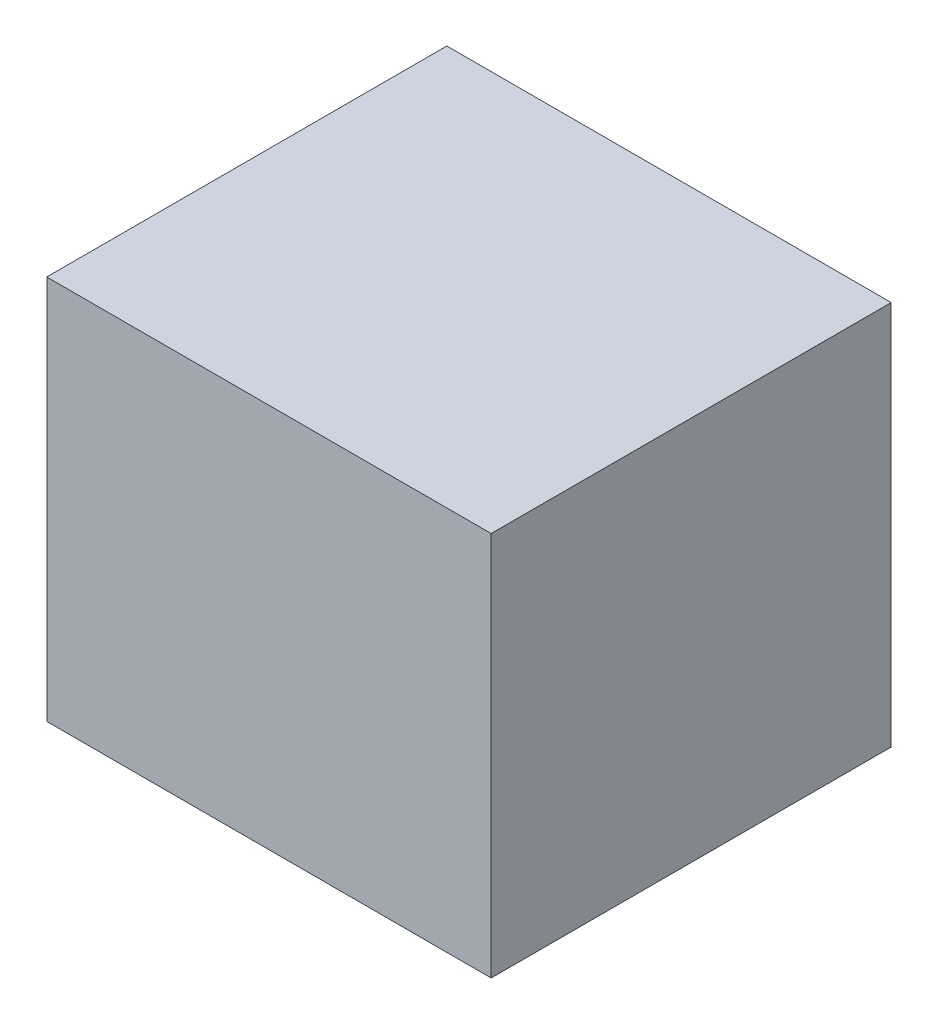
ISO-10303-21;
HEADER;
FILE_DESCRIPTION(('STEP AP214'),'2;1');
FILE_NAME('part.step','',(''),(''),'','','');
FILE_SCHEMA(('AUTOMOTIVE_DESIGN { 1 0 10303 214 1 1 1 1 }'));
ENDSEC;
DATA;
#1=APPLICATION_CONTEXT('core data for automotive mechanical design processes');
#2=APPLICATION_PROTOCOL_DEFINITION('international standard','automotive_design',2000,#1);
#3=PRODUCT_CONTEXT('',#1,'mechanical');
#4=PRODUCT('Part','Part','',(#3));
#5=PRODUCT_RELATED_PRODUCT_CATEGORY('part','',(#4));
#6=PRODUCT_DEFINITION_FORMATION('','',#4);
#7=PRODUCT_DEFINITION_CONTEXT('part definition',#1,'design');
#8=PRODUCT_DEFINITION('design','',#6,#7);
#9=PRODUCT_DEFINITION_SHAPE('','',#8);
#10=(LENGTH_UNIT() NAMED_UNIT(*) SI_UNIT(.MILLI.,.METRE.));
#11=(NAMED_UNIT(*) PLANE_ANGLE_UNIT() SI_UNIT($,.RADIAN.));
#12=(NAMED_UNIT(*) SI_UNIT($,.STERADIAN.) SOLID_ANGLE_UNIT());
#13=UNCERTAINTY_MEASURE_WITH_UNIT(LENGTH_MEASURE(1.E-05),#10,'distance_accuracy_value','');
#14=(GEOMETRIC_REPRESENTATION_CONTEXT(3) GLOBAL_UNCERTAINTY_ASSIGNED_CONTEXT((#13)) GLOBAL_UNIT_ASSIGNED_CONTEXT((#10,
#11,#12)) REPRESENTATION_CONTEXT('',''));
#15=CARTESIAN_POINT('',(0.,0.,0.));
#16=DIRECTION('',(0.,0.,1.));
#17=DIRECTION('',(1.,0.,0.));
#18=AXIS2_PLACEMENT_3D('',#15,#16,#17);
#19=CARTESIAN_POINT('',(3.81,6.6,3.43000000000001));
#20=DIRECTION('',(-1.,0.,0.));
#21=DIRECTION('',(0.,0.,1.));
#22=AXIS2_PLACEMENT_3D('',#19,#20,#21);
#23=PLANE('',#22);
#24=DIRECTION('',(0.,0.,-1.));
#25=VECTOR('',#24,1.);
#26=CARTESIAN_POINT('',(3.81,0.,3.43000000000001));
#27=LINE('',#26,#25);
#28=CARTESIAN_POINT('',(3.81,0.,3.43000000000001));
#29=VERTEX_POINT('',#28);
#30=CARTESIAN_POINT('',(3.81,0.,-3.43));
#31=VERTEX_POINT('',#30);
#32=EDGE_CURVE('E96',#29,#31,#27,.T.);
#33=ORIENTED_EDGE('',*,*,#32,.T.);
#34=DIRECTION('',(0.,-1.,0.));
#35=VECTOR('',#34,1.);
#36=CARTESIAN_POINT('',(3.81,6.6,-3.43));
#37=LINE('',#36,#35);
#38=CARTESIAN_POINT('',(3.81,6.6,-3.43));
#39=VERTEX_POINT('',#38);
#40=EDGE_CURVE('E11',#39,#31,#37,.T.);
#41=ORIENTED_EDGE('',*,*,#40,.F.);
#42=DIRECTION('',(0.,0.,-1.));
#43=VECTOR('',#42,1.);
#44=CARTESIAN_POINT('',(3.81,6.6,3.43000000000001));
#45=LINE('',#44,#43);
#46=CARTESIAN_POINT('',(3.81,6.6,3.43000000000001));
#47=VERTEX_POINT('',#46);
#48=EDGE_CURVE('E84',#47,#39,#45,.T.);
#49=ORIENTED_EDGE('',*,*,#48,.F.);
#50=DIRECTION('',(0.,-1.,0.));
#51=VECTOR('',#50,1.);
#52=CARTESIAN_POINT('',(3.81,6.6,3.43000000000001));
#53=LINE('',#52,#51);
#54=EDGE_CURVE('E92',#47,#29,#53,.T.);
#55=ORIENTED_EDGE('',*,*,#54,.T.);
#56=EDGE_LOOP('',(#33,#41,#49,#55));
#57=FACE_BOUND('',#56,.T.);
#58=ADVANCED_FACE('F33',(#57),#23,.F.);
#59=CARTESIAN_POINT('',(-3.81,6.6,-3.43));
#60=DIRECTION('',(0.,0.,1.));
#61=DIRECTION('',(1.,0.,0.));
#62=AXIS2_PLACEMENT_3D('',#59,#60,#61);
#63=PLANE('',#62);
#64=DIRECTION('',(-1.,0.,0.));
#65=VECTOR('',#64,1.);
#66=CARTESIAN_POINT('',(-3.81,0.,-3.43));
#67=LINE('',#66,#65);
#68=CARTESIAN_POINT('',(-3.81,0.,-3.43));
#69=VERTEX_POINT('',#68);
#70=EDGE_CURVE('E88',#31,#69,#67,.T.);
#71=ORIENTED_EDGE('',*,*,#70,.T.);
#72=DIRECTION('',(0.,-1.,0.));
#73=VECTOR('',#72,1.);
#74=CARTESIAN_POINT('',(-3.81,6.6,-3.43));
#75=LINE('',#74,#73);
#76=CARTESIAN_POINT('',(-3.81,6.6,-3.43));
#77=VERTEX_POINT('',#76);
#78=EDGE_CURVE('E41',#77,#69,#75,.T.);
#79=ORIENTED_EDGE('',*,*,#78,.F.);
#80=DIRECTION('',(-1.,0.,0.));
#81=VECTOR('',#80,1.);
#82=CARTESIAN_POINT('',(-3.81,6.6,-3.43));
#83=LINE('',#82,#81);
#84=EDGE_CURVE('E79',#39,#77,#83,.T.);
#85=ORIENTED_EDGE('',*,*,#84,.F.);
#86=ORIENTED_EDGE('',*,*,#40,.T.);
#87=EDGE_LOOP('',(#71,#79,#85,#86));
#88=FACE_BOUND('',#87,.T.);
#89=ADVANCED_FACE('F87',(#88),#63,.F.);
#90=CARTESIAN_POINT('',(-3.81,6.6,3.43000000000001));
#91=DIRECTION('',(1.,0.,0.));
#92=DIRECTION('',(0.,0.,-1.));
#93=AXIS2_PLACEMENT_3D('',#90,#91,#92);
#94=PLANE('',#93);
#95=DIRECTION('',(0.,0.,1.));
#96=VECTOR('',#95,1.);
#97=CARTESIAN_POINT('',(-3.81,0.,3.43000000000001));
#98=LINE('',#97,#96);
#99=CARTESIAN_POINT('',(-3.81,0.,3.43000000000001));
#100=VERTEX_POINT('',#99);
#101=EDGE_CURVE('E66',#69,#100,#98,.T.);
#102=ORIENTED_EDGE('',*,*,#101,.T.);
#103=DIRECTION('',(0.,-1.,0.));
#104=VECTOR('',#103,1.);
#105=CARTESIAN_POINT('',(-3.81,6.6,3.43000000000001));
#106=LINE('',#105,#104);
#107=CARTESIAN_POINT('',(-3.81,6.6,3.43000000000001));
#108=VERTEX_POINT('',#107);
#109=EDGE_CURVE('E89',#108,#100,#106,.T.);
#110=ORIENTED_EDGE('',*,*,#109,.F.);
#111=DIRECTION('',(0.,0.,1.));
#112=VECTOR('',#111,1.);
#113=CARTESIAN_POINT('',(-3.81,6.6,3.43000000000001));
#114=LINE('',#113,#112);
#115=EDGE_CURVE('E82',#77,#108,#114,.T.);
#116=ORIENTED_EDGE('',*,*,#115,.F.);
#117=ORIENTED_EDGE('',*,*,#78,.T.);
#118=EDGE_LOOP('',(#102,#110,#116,#117));
#119=FACE_BOUND('',#118,.T.);
#120=ADVANCED_FACE('F90',(#119),#94,.F.);
#121=CARTESIAN_POINT('',(-3.81,6.6,3.43000000000001));
#122=DIRECTION('',(0.,0.,-1.));
#123=DIRECTION('',(-1.,0.,0.));
#124=AXIS2_PLACEMENT_3D('',#121,#122,#123);
#125=PLANE('',#124);
#126=DIRECTION('',(1.,0.,0.));
#127=VECTOR('',#126,1.);
#128=CARTESIAN_POINT('',(-3.81,0.,3.43000000000001));
#129=LINE('',#128,#127);
#130=EDGE_CURVE('E72',#100,#29,#129,.T.);
#131=ORIENTED_EDGE('',*,*,#130,.T.);
#132=ORIENTED_EDGE('',*,*,#54,.F.);
#133=DIRECTION('',(1.,0.,0.));
#134=VECTOR('',#133,1.);
#135=CARTESIAN_POINT('',(-3.81,6.6,3.43000000000001));
#136=LINE('',#135,#134);
#137=EDGE_CURVE('E49',#108,#47,#136,.T.);
#138=ORIENTED_EDGE('',*,*,#137,.F.);
#139=ORIENTED_EDGE('',*,*,#109,.T.);
#140=EDGE_LOOP('',(#131,#132,#138,#139));
#141=FACE_BOUND('',#140,.T.);
#142=ADVANCED_FACE('F103',(#141),#125,.F.);
#143=CARTESIAN_POINT('',(0.,6.6,0.));
#144=DIRECTION('',(0.,-1.,0.));
#145=DIRECTION('',(0.,0.,-1.));
#146=AXIS2_PLACEMENT_3D('',#143,#144,#145);
#147=PLANE('',#146);
#148=ORIENTED_EDGE('',*,*,#48,.T.);
#149=ORIENTED_EDGE('',*,*,#84,.T.);
#150=ORIENTED_EDGE('',*,*,#115,.T.);
#151=ORIENTED_EDGE('',*,*,#137,.T.);
#152=EDGE_LOOP('',(#148,#149,#150,#151));
#153=FACE_BOUND('',#152,.T.);
#154=ADVANCED_FACE('F80',(#153),#147,.F.);
#155=CARTESIAN_POINT('',(0.,0.,0.));
#156=DIRECTION('',(0.,-1.,0.));
#157=DIRECTION('',(0.,0.,-1.));
#158=AXIS2_PLACEMENT_3D('',#155,#156,#157);
#159=PLANE('',#158);
#160=ORIENTED_EDGE('',*,*,#32,.F.);
#161=ORIENTED_EDGE('',*,*,#130,.F.);
#162=ORIENTED_EDGE('',*,*,#101,.F.);
#163=ORIENTED_EDGE('',*,*,#70,.F.);
#164=EDGE_LOOP('',(#160,#161,#162,#163));
#165=FACE_BOUND('',#164,.T.);
#166=ADVANCED_FACE('F106',(#165),#159,.T.);
#167=CLOSED_SHELL('',(#58,#89,#120,#142,#154,#166));
#168=MANIFOLD_SOLID_BREP('B2',#167);
#169=ADVANCED_BREP_SHAPE_REPRESENTATION('',(#18,#168),#14);
#170=SHAPE_DEFINITION_REPRESENTATION(#9,#169);
ENDSEC;
END-ISO-10303-21;
